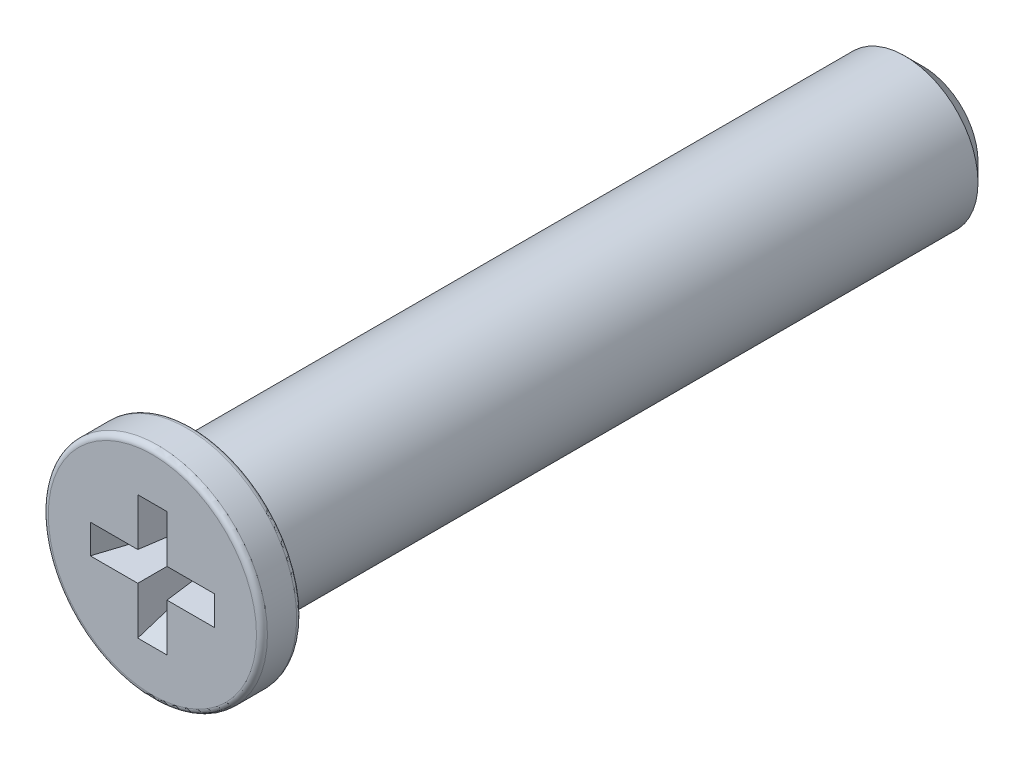
ISO-10303-21;
HEADER;
FILE_DESCRIPTION(('STEP AP214'),'2;1');
FILE_NAME('part.step','',(''),(''),'','','');
FILE_SCHEMA(('AUTOMOTIVE_DESIGN { 1 0 10303 214 1 1 1 1 }'));
ENDSEC;
DATA;
#1=APPLICATION_CONTEXT('core data for automotive mechanical design processes');
#2=APPLICATION_PROTOCOL_DEFINITION('international standard','automotive_design',2000,#1);
#3=PRODUCT_CONTEXT('',#1,'mechanical');
#4=PRODUCT('Part','Part','',(#3));
#5=PRODUCT_RELATED_PRODUCT_CATEGORY('part','',(#4));
#6=PRODUCT_DEFINITION_FORMATION('','',#4);
#7=PRODUCT_DEFINITION_CONTEXT('part definition',#1,'design');
#8=PRODUCT_DEFINITION('design','',#6,#7);
#9=PRODUCT_DEFINITION_SHAPE('','',#8);
#10=(LENGTH_UNIT() NAMED_UNIT(*) SI_UNIT(.MILLI.,.METRE.));
#11=(NAMED_UNIT(*) PLANE_ANGLE_UNIT() SI_UNIT($,.RADIAN.));
#12=(NAMED_UNIT(*) SI_UNIT($,.STERADIAN.) SOLID_ANGLE_UNIT());
#13=UNCERTAINTY_MEASURE_WITH_UNIT(LENGTH_MEASURE(1.E-05),#10,'distance_accuracy_value','');
#14=(GEOMETRIC_REPRESENTATION_CONTEXT(3) GLOBAL_UNCERTAINTY_ASSIGNED_CONTEXT((#13)) GLOBAL_UNIT_ASSIGNED_CONTEXT((#10,
#11,#12)) REPRESENTATION_CONTEXT('',''));
#15=CARTESIAN_POINT('',(0.,0.,0.));
#16=DIRECTION('',(0.,0.,1.));
#17=DIRECTION('',(1.,0.,0.));
#18=AXIS2_PLACEMENT_3D('',#15,#16,#17);
#19=CARTESIAN_POINT('',(12.1,11.25,7.5));
#20=DIRECTION('',(-0.923879532511287,0.,0.38268343236509));
#21=DIRECTION('',(0.38268343236509,0.,0.923879532511287));
#22=AXIS2_PLACEMENT_3D('',#19,#20,#21);
#23=PLANE('',#22);
#24=DIRECTION('',(0.,1.,0.));
#25=VECTOR('',#24,1.);
#26=CARTESIAN_POINT('',(11.6029437251523,11.25,6.30000000000001));
#27=LINE('',#26,#25);
#28=CARTESIAN_POINT('',(11.6029437251523,11.3660878256678,6.3));
#29=VERTEX_POINT('',#28);
#30=CARTESIAN_POINT('',(11.6029437251523,11.1339121743322,6.3));
#31=VERTEX_POINT('',#30);
#32=EDGE_CURVE('E117',#29,#31,#27,.F.);
#33=ORIENTED_EDGE('',*,*,#32,.T.);
#34=DIRECTION('',(-0.381887326256782,0.0644695530821726,-0.921957562347547));
#35=VECTOR('',#34,1.);
#36=CARTESIAN_POINT('',(12.1,11.05,7.5));
#37=LINE('',#36,#35);
#38=CARTESIAN_POINT('',(12.1,11.05,7.5));
#39=VERTEX_POINT('',#38);
#40=EDGE_CURVE('E133',#39,#31,#37,.T.);
#41=ORIENTED_EDGE('',*,*,#40,.F.);
#42=DIRECTION('',(0.,1.,0.));
#43=VECTOR('',#42,1.);
#44=CARTESIAN_POINT('',(12.1,11.25,7.5));
#45=LINE('',#44,#43);
#46=CARTESIAN_POINT('',(12.1,11.45,7.5));
#47=VERTEX_POINT('',#46);
#48=EDGE_CURVE('E122',#39,#47,#45,.T.);
#49=ORIENTED_EDGE('',*,*,#48,.T.);
#50=DIRECTION('',(0.381887326256781,0.0644695530821739,0.921957562347547));
#51=VECTOR('',#50,1.);
#52=CARTESIAN_POINT('',(11.6029437251523,11.3660878256678,6.3));
#53=LINE('',#52,#51);
#54=EDGE_CURVE('E286',#29,#47,#53,.T.);
#55=ORIENTED_EDGE('',*,*,#54,.F.);
#56=EDGE_LOOP('',(#33,#41,#49,#55));
#57=FACE_BOUND('',#56,.T.);
#58=ADVANCED_FACE('F17',(#57),#23,.T.);
#59=CARTESIAN_POINT('',(11.25,11.05,7.5));
#60=DIRECTION('',(0.,0.997564050259824,0.0697564737441253));
#61=DIRECTION('',(0.,-0.0697564737441253,0.997564050259824));
#62=AXIS2_PLACEMENT_3D('',#59,#60,#61);
#63=PLANE('',#62);
#64=DIRECTION('',(1.,0.,0.));
#65=VECTOR('',#64,1.);
#66=CARTESIAN_POINT('',(11.25,11.1339121743322,6.3));
#67=LINE('',#66,#65);
#68=CARTESIAN_POINT('',(11.3660878256678,11.1339121743322,6.3));
#69=VERTEX_POINT('',#68);
#70=EDGE_CURVE('E135',#31,#69,#67,.F.);
#71=ORIENTED_EDGE('',*,*,#70,.T.);
#72=DIRECTION('',(-0.0695873743166644,0.0695873743166544,-0.995145815783509));
#73=VECTOR('',#72,1.);
#74=CARTESIAN_POINT('',(11.45,11.05,7.5));
#75=LINE('',#74,#73);
#76=CARTESIAN_POINT('',(11.45,11.05,7.5));
#77=VERTEX_POINT('',#76);
#78=EDGE_CURVE('E139',#77,#69,#75,.T.);
#79=ORIENTED_EDGE('',*,*,#78,.F.);
#80=DIRECTION('',(1.,0.,0.));
#81=VECTOR('',#80,1.);
#82=CARTESIAN_POINT('',(11.25,11.05,7.5));
#83=LINE('',#82,#81);
#84=EDGE_CURVE('E126',#77,#39,#83,.T.);
#85=ORIENTED_EDGE('',*,*,#84,.T.);
#86=ORIENTED_EDGE('',*,*,#40,.T.);
#87=EDGE_LOOP('',(#71,#79,#85,#86));
#88=FACE_BOUND('',#87,.T.);
#89=ADVANCED_FACE('F137',(#88),#63,.T.);
#90=CARTESIAN_POINT('',(11.25,11.45,7.5));
#91=DIRECTION('',(0.,-0.997564050259824,0.0697564737441253));
#92=DIRECTION('',(0.,-0.0697564737441253,-0.997564050259824));
#93=AXIS2_PLACEMENT_3D('',#90,#91,#92);
#94=PLANE('',#93);
#95=DIRECTION('',(1.,0.,0.));
#96=VECTOR('',#95,1.);
#97=CARTESIAN_POINT('',(11.25,11.3660878256678,6.3));
#98=LINE('',#97,#96);
#99=CARTESIAN_POINT('',(11.3660878256678,11.3660878256678,6.3));
#100=VERTEX_POINT('',#99);
#101=EDGE_CURVE('E288',#100,#29,#98,.T.);
#102=ORIENTED_EDGE('',*,*,#101,.T.);
#103=ORIENTED_EDGE('',*,*,#54,.T.);
#104=DIRECTION('',(1.,0.,0.));
#105=VECTOR('',#104,1.);
#106=CARTESIAN_POINT('',(11.25,11.45,7.5));
#107=LINE('',#106,#105);
#108=CARTESIAN_POINT('',(11.45,11.45,7.5));
#109=VERTEX_POINT('',#108);
#110=EDGE_CURVE('E129',#47,#109,#107,.F.);
#111=ORIENTED_EDGE('',*,*,#110,.T.);
#112=DIRECTION('',(0.0695873743166644,0.0695873743166544,0.995145815783509));
#113=VECTOR('',#112,1.);
#114=CARTESIAN_POINT('',(11.3660878256678,11.3660878256678,6.3));
#115=LINE('',#114,#113);
#116=EDGE_CURVE('E272',#100,#109,#115,.T.);
#117=ORIENTED_EDGE('',*,*,#116,.F.);
#118=EDGE_LOOP('',(#102,#103,#111,#117));
#119=FACE_BOUND('',#118,.T.);
#120=ADVANCED_FACE('F459',(#119),#94,.T.);
#121=CARTESIAN_POINT('',(11.45,11.25,7.5));
#122=DIRECTION('',(-0.997564050259824,0.,0.0697564737441253));
#123=DIRECTION('',(0.0697564737441253,0.,0.997564050259824));
#124=AXIS2_PLACEMENT_3D('',#121,#122,#123);
#125=PLANE('',#124);
#126=DIRECTION('',(0.,1.,0.));
#127=VECTOR('',#126,1.);
#128=CARTESIAN_POINT('',(11.3660878256678,11.25,6.3));
#129=LINE('',#128,#127);
#130=CARTESIAN_POINT('',(11.3660878256678,10.8970562748477,6.3));
#131=VERTEX_POINT('',#130);
#132=EDGE_CURVE('E281',#69,#131,#129,.F.);
#133=ORIENTED_EDGE('',*,*,#132,.T.);
#134=DIRECTION('',(-0.0644695530821647,0.381887326256791,-0.921957562347544));
#135=VECTOR('',#134,1.);
#136=CARTESIAN_POINT('',(11.45,10.4,7.5));
#137=LINE('',#136,#135);
#138=CARTESIAN_POINT('',(11.45,10.4,7.5));
#139=VERTEX_POINT('',#138);
#140=EDGE_CURVE('E266',#139,#131,#137,.T.);
#141=ORIENTED_EDGE('',*,*,#140,.F.);
#142=DIRECTION('',(0.,1.,0.));
#143=VECTOR('',#142,1.);
#144=CARTESIAN_POINT('',(11.45,11.25,7.5));
#145=LINE('',#144,#143);
#146=EDGE_CURVE('E284',#139,#77,#145,.T.);
#147=ORIENTED_EDGE('',*,*,#146,.T.);
#148=ORIENTED_EDGE('',*,*,#78,.T.);
#149=EDGE_LOOP('',(#133,#141,#147,#148));
#150=FACE_BOUND('',#149,.T.);
#151=ADVANCED_FACE('F298',(#150),#125,.T.);
#152=CARTESIAN_POINT('',(11.45,11.25,7.5));
#153=DIRECTION('',(-0.997564050259824,0.,0.0697564737441253));
#154=DIRECTION('',(0.0697564737441253,0.,0.997564050259824));
#155=AXIS2_PLACEMENT_3D('',#152,#153,#154);
#156=PLANE('',#155);
#157=DIRECTION('',(0.,1.,0.));
#158=VECTOR('',#157,1.);
#159=CARTESIAN_POINT('',(11.3660878256678,11.25,6.3));
#160=LINE('',#159,#158);
#161=CARTESIAN_POINT('',(11.3660878256678,11.6029437251523,6.3));
#162=VERTEX_POINT('',#161);
#163=EDGE_CURVE('E275',#162,#100,#160,.F.);
#164=ORIENTED_EDGE('',*,*,#163,.T.);
#165=ORIENTED_EDGE('',*,*,#116,.T.);
#166=DIRECTION('',(0.,1.,0.));
#167=VECTOR('',#166,1.);
#168=CARTESIAN_POINT('',(11.45,11.25,7.5));
#169=LINE('',#168,#167);
#170=CARTESIAN_POINT('',(11.45,12.1,7.5));
#171=VERTEX_POINT('',#170);
#172=EDGE_CURVE('E278',#109,#171,#169,.T.);
#173=ORIENTED_EDGE('',*,*,#172,.T.);
#174=DIRECTION('',(0.0644695530821646,0.381887326256791,0.921957562347544));
#175=VECTOR('',#174,1.);
#176=CARTESIAN_POINT('',(11.3660878256678,11.6029437251523,6.30000000000001));
#177=LINE('',#176,#175);
#178=EDGE_CURVE('E255',#162,#171,#177,.T.);
#179=ORIENTED_EDGE('',*,*,#178,.F.);
#180=EDGE_LOOP('',(#164,#165,#173,#179));
#181=FACE_BOUND('',#180,.T.);
#182=ADVANCED_FACE('F445',(#181),#156,.T.);
#183=CARTESIAN_POINT('',(11.25,10.4,7.5));
#184=DIRECTION('',(0.,0.923879532511287,0.38268343236509));
#185=DIRECTION('',(0.,-0.38268343236509,0.923879532511287));
#186=AXIS2_PLACEMENT_3D('',#183,#184,#185);
#187=PLANE('',#186);
#188=DIRECTION('',(1.,0.,0.));
#189=VECTOR('',#188,1.);
#190=CARTESIAN_POINT('',(11.25,10.8970562748477,6.30000000000001));
#191=LINE('',#190,#189);
#192=CARTESIAN_POINT('',(11.1339121743322,10.8970562748477,6.3));
#193=VERTEX_POINT('',#192);
#194=EDGE_CURVE('E264',#131,#193,#191,.F.);
#195=ORIENTED_EDGE('',*,*,#194,.T.);
#196=DIRECTION('',(0.0644695530821727,0.38188732625678,-0.921957562347548));
#197=VECTOR('',#196,1.);
#198=CARTESIAN_POINT('',(11.05,10.4,7.5));
#199=LINE('',#198,#197);
#200=CARTESIAN_POINT('',(11.05,10.4,7.5));
#201=VERTEX_POINT('',#200);
#202=EDGE_CURVE('E249',#201,#193,#199,.T.);
#203=ORIENTED_EDGE('',*,*,#202,.F.);
#204=DIRECTION('',(1.,0.,0.));
#205=VECTOR('',#204,1.);
#206=CARTESIAN_POINT('',(11.25,10.4,7.5));
#207=LINE('',#206,#205);
#208=EDGE_CURVE('E269',#201,#139,#207,.T.);
#209=ORIENTED_EDGE('',*,*,#208,.T.);
#210=ORIENTED_EDGE('',*,*,#140,.T.);
#211=EDGE_LOOP('',(#195,#203,#209,#210));
#212=FACE_BOUND('',#211,.T.);
#213=ADVANCED_FACE('F302',(#212),#187,.T.);
#214=CARTESIAN_POINT('',(11.25,12.1,7.5));
#215=DIRECTION('',(0.,-0.923879532511287,0.38268343236509));
#216=DIRECTION('',(0.,-0.38268343236509,-0.923879532511287));
#217=AXIS2_PLACEMENT_3D('',#214,#215,#216);
#218=PLANE('',#217);
#219=DIRECTION('',(1.,0.,0.));
#220=VECTOR('',#219,1.);
#221=CARTESIAN_POINT('',(11.25,11.6029437251523,6.30000000000001));
#222=LINE('',#221,#220);
#223=CARTESIAN_POINT('',(11.1339121743322,11.6029437251523,6.3));
#224=VERTEX_POINT('',#223);
#225=EDGE_CURVE('E258',#224,#162,#222,.T.);
#226=ORIENTED_EDGE('',*,*,#225,.T.);
#227=ORIENTED_EDGE('',*,*,#178,.T.);
#228=DIRECTION('',(1.,0.,0.));
#229=VECTOR('',#228,1.);
#230=CARTESIAN_POINT('',(11.25,12.1,7.5));
#231=LINE('',#230,#229);
#232=CARTESIAN_POINT('',(11.05,12.1,7.5));
#233=VERTEX_POINT('',#232);
#234=EDGE_CURVE('E261',#171,#233,#231,.F.);
#235=ORIENTED_EDGE('',*,*,#234,.T.);
#236=DIRECTION('',(-0.0644695530821739,0.381887326256781,0.921957562347547));
#237=VECTOR('',#236,1.);
#238=CARTESIAN_POINT('',(11.1339121743322,11.6029437251523,6.3));
#239=LINE('',#238,#237);
#240=EDGE_CURVE('E241',#224,#233,#239,.T.);
#241=ORIENTED_EDGE('',*,*,#240,.F.);
#242=EDGE_LOOP('',(#226,#227,#235,#241));
#243=FACE_BOUND('',#242,.T.);
#244=ADVANCED_FACE('F431',(#243),#218,.T.);
#245=CARTESIAN_POINT('',(11.05,11.25,7.5));
#246=DIRECTION('',(0.997564050259824,0.,0.0697564737441253));
#247=DIRECTION('',(0.0697564737441253,0.,-0.997564050259824));
#248=AXIS2_PLACEMENT_3D('',#245,#246,#247);
#249=PLANE('',#248);
#250=DIRECTION('',(0.,1.,0.));
#251=VECTOR('',#250,1.);
#252=CARTESIAN_POINT('',(11.1339121743322,11.25,6.3));
#253=LINE('',#252,#251);
#254=CARTESIAN_POINT('',(11.1339121743322,11.1339121743322,6.3));
#255=VERTEX_POINT('',#254);
#256=EDGE_CURVE('E247',#193,#255,#253,.T.);
#257=ORIENTED_EDGE('',*,*,#256,.T.);
#258=DIRECTION('',(0.0695873743166544,0.0695873743166644,-0.995145815783509));
#259=VECTOR('',#258,1.);
#260=CARTESIAN_POINT('',(11.05,11.05,7.5));
#261=LINE('',#260,#259);
#262=CARTESIAN_POINT('',(11.05,11.05,7.5));
#263=VERTEX_POINT('',#262);
#264=EDGE_CURVE('E235',#263,#255,#261,.T.);
#265=ORIENTED_EDGE('',*,*,#264,.F.);
#266=DIRECTION('',(0.,1.,0.));
#267=VECTOR('',#266,1.);
#268=CARTESIAN_POINT('',(11.05,11.25,7.5));
#269=LINE('',#268,#267);
#270=EDGE_CURVE('E252',#263,#201,#269,.F.);
#271=ORIENTED_EDGE('',*,*,#270,.T.);
#272=ORIENTED_EDGE('',*,*,#202,.T.);
#273=EDGE_LOOP('',(#257,#265,#271,#272));
#274=FACE_BOUND('',#273,.T.);
#275=ADVANCED_FACE('F304',(#274),#249,.T.);
#276=CARTESIAN_POINT('',(11.05,11.25,7.5));
#277=DIRECTION('',(0.997564050259824,0.,0.0697564737441253));
#278=DIRECTION('',(0.0697564737441253,0.,-0.997564050259824));
#279=AXIS2_PLACEMENT_3D('',#276,#277,#278);
#280=PLANE('',#279);
#281=DIRECTION('',(0.,1.,0.));
#282=VECTOR('',#281,1.);
#283=CARTESIAN_POINT('',(11.1339121743322,11.25,6.3));
#284=LINE('',#283,#282);
#285=CARTESIAN_POINT('',(11.1339121743322,11.3660878256678,6.3));
#286=VERTEX_POINT('',#285);
#287=EDGE_CURVE('E230',#224,#286,#284,.F.);
#288=ORIENTED_EDGE('',*,*,#287,.F.);
#289=ORIENTED_EDGE('',*,*,#240,.T.);
#290=DIRECTION('',(0.,1.,0.));
#291=VECTOR('',#290,1.);
#292=CARTESIAN_POINT('',(11.05,11.25,7.5));
#293=LINE('',#292,#291);
#294=CARTESIAN_POINT('',(11.05,11.45,7.5));
#295=VERTEX_POINT('',#294);
#296=EDGE_CURVE('E244',#233,#295,#293,.F.);
#297=ORIENTED_EDGE('',*,*,#296,.T.);
#298=DIRECTION('',(-0.0695873743166544,0.0695873743166644,0.995145815783509));
#299=VECTOR('',#298,1.);
#300=CARTESIAN_POINT('',(11.1339121743322,11.3660878256678,6.3));
#301=LINE('',#300,#299);
#302=EDGE_CURVE('E222',#286,#295,#301,.T.);
#303=ORIENTED_EDGE('',*,*,#302,.F.);
#304=EDGE_LOOP('',(#288,#289,#297,#303));
#305=FACE_BOUND('',#304,.T.);
#306=ADVANCED_FACE('F417',(#305),#280,.T.);
#307=CARTESIAN_POINT('',(11.25,11.05,7.5));
#308=DIRECTION('',(0.,0.997564050259824,0.0697564737441253));
#309=DIRECTION('',(0.,-0.0697564737441253,0.997564050259824));
#310=AXIS2_PLACEMENT_3D('',#307,#308,#309);
#311=PLANE('',#310);
#312=DIRECTION('',(1.,0.,0.));
#313=VECTOR('',#312,1.);
#314=CARTESIAN_POINT('',(11.25,11.1339121743322,6.3));
#315=LINE('',#314,#313);
#316=CARTESIAN_POINT('',(10.8970562748477,11.1339121743322,6.3));
#317=VERTEX_POINT('',#316);
#318=EDGE_CURVE('E232',#317,#255,#315,.T.);
#319=ORIENTED_EDGE('',*,*,#318,.F.);
#320=DIRECTION('',(0.381887326256791,0.0644695530821647,-0.921957562347544));
#321=VECTOR('',#320,1.);
#322=CARTESIAN_POINT('',(10.4,11.05,7.5));
#323=LINE('',#322,#321);
#324=CARTESIAN_POINT('',(10.4,11.05,7.5));
#325=VERTEX_POINT('',#324);
#326=EDGE_CURVE('E219',#325,#317,#323,.T.);
#327=ORIENTED_EDGE('',*,*,#326,.F.);
#328=DIRECTION('',(1.,0.,0.));
#329=VECTOR('',#328,1.);
#330=CARTESIAN_POINT('',(11.25,11.05,7.5));
#331=LINE('',#330,#329);
#332=EDGE_CURVE('E238',#325,#263,#331,.T.);
#333=ORIENTED_EDGE('',*,*,#332,.T.);
#334=ORIENTED_EDGE('',*,*,#264,.T.);
#335=EDGE_LOOP('',(#319,#327,#333,#334));
#336=FACE_BOUND('',#335,.T.);
#337=ADVANCED_FACE('F307',(#336),#311,.T.);
#338=CARTESIAN_POINT('',(11.25,11.25,6.3));
#339=DIRECTION('',(0.,0.,1.));
#340=DIRECTION('',(1.,0.,0.));
#341=AXIS2_PLACEMENT_3D('',#338,#339,#340);
#342=PLANE('',#341);
#343=ORIENTED_EDGE('',*,*,#225,.F.);
#344=ORIENTED_EDGE('',*,*,#287,.T.);
#345=DIRECTION('',(1.,0.,0.));
#346=VECTOR('',#345,1.);
#347=CARTESIAN_POINT('',(11.25,11.3660878256678,6.3));
#348=LINE('',#347,#346);
#349=CARTESIAN_POINT('',(10.8970562748477,11.3660878256678,6.3));
#350=VERTEX_POINT('',#349);
#351=EDGE_CURVE('E225',#350,#286,#348,.T.);
#352=ORIENTED_EDGE('',*,*,#351,.F.);
#353=DIRECTION('',(0.,1.,0.));
#354=VECTOR('',#353,1.);
#355=CARTESIAN_POINT('',(10.8970562748477,11.25,6.30000000000001));
#356=LINE('',#355,#354);
#357=EDGE_CURVE('E216',#317,#350,#356,.T.);
#358=ORIENTED_EDGE('',*,*,#357,.F.);
#359=ORIENTED_EDGE('',*,*,#318,.T.);
#360=ORIENTED_EDGE('',*,*,#256,.F.);
#361=ORIENTED_EDGE('',*,*,#194,.F.);
#362=ORIENTED_EDGE('',*,*,#132,.F.);
#363=ORIENTED_EDGE('',*,*,#70,.F.);
#364=ORIENTED_EDGE('',*,*,#32,.F.);
#365=ORIENTED_EDGE('',*,*,#101,.F.);
#366=ORIENTED_EDGE('',*,*,#163,.F.);
#367=EDGE_LOOP('',(#343,#344,#352,#358,#359,#360,#361,#362,#363,#364,#365,#366));
#368=FACE_BOUND('',#367,.T.);
#369=ADVANCED_FACE('F294',(#368),#342,.T.);
#370=CARTESIAN_POINT('',(11.25,11.45,7.5));
#371=DIRECTION('',(0.,-0.997564050259824,0.0697564737441253));
#372=DIRECTION('',(0.,-0.0697564737441253,-0.997564050259824));
#373=AXIS2_PLACEMENT_3D('',#370,#371,#372);
#374=PLANE('',#373);
#375=ORIENTED_EDGE('',*,*,#351,.T.);
#376=ORIENTED_EDGE('',*,*,#302,.T.);
#377=DIRECTION('',(1.,0.,0.));
#378=VECTOR('',#377,1.);
#379=CARTESIAN_POINT('',(11.25,11.45,7.5));
#380=LINE('',#379,#378);
#381=CARTESIAN_POINT('',(10.4,11.45,7.5));
#382=VERTEX_POINT('',#381);
#383=EDGE_CURVE('E228',#295,#382,#380,.F.);
#384=ORIENTED_EDGE('',*,*,#383,.T.);
#385=DIRECTION('',(-0.381887326256791,0.0644695530821647,0.921957562347544));
#386=VECTOR('',#385,1.);
#387=CARTESIAN_POINT('',(10.8970562748477,11.3660878256678,6.30000000000001));
#388=LINE('',#387,#386);
#389=EDGE_CURVE('E207',#350,#382,#388,.T.);
#390=ORIENTED_EDGE('',*,*,#389,.F.);
#391=EDGE_LOOP('',(#375,#376,#384,#390));
#392=FACE_BOUND('',#391,.T.);
#393=ADVANCED_FACE('F336',(#392),#374,.T.);
#394=CARTESIAN_POINT('',(10.4,11.25,7.5));
#395=DIRECTION('',(0.923879532511287,0.,0.38268343236509));
#396=DIRECTION('',(0.38268343236509,0.,-0.923879532511287));
#397=AXIS2_PLACEMENT_3D('',#394,#395,#396);
#398=PLANE('',#397);
#399=ORIENTED_EDGE('',*,*,#357,.T.);
#400=ORIENTED_EDGE('',*,*,#389,.T.);
#401=DIRECTION('',(0.,1.,0.));
#402=VECTOR('',#401,1.);
#403=CARTESIAN_POINT('',(10.4,11.25,7.5));
#404=LINE('',#403,#402);
#405=EDGE_CURVE('E215',#382,#325,#404,.F.);
#406=ORIENTED_EDGE('',*,*,#405,.T.);
#407=ORIENTED_EDGE('',*,*,#326,.T.);
#408=EDGE_LOOP('',(#399,#400,#406,#407));
#409=FACE_BOUND('',#408,.T.);
#410=ADVANCED_FACE('F331',(#409),#398,.T.);
#411=CARTESIAN_POINT('',(11.25,11.25,7.5));
#412=DIRECTION('',(0.,0.,-1.));
#413=DIRECTION('',(-1.,0.,0.));
#414=AXIS2_PLACEMENT_3D('',#411,#412,#413);
#415=PLANE('',#414);
#416=ORIENTED_EDGE('',*,*,#383,.F.);
#417=ORIENTED_EDGE('',*,*,#296,.F.);
#418=ORIENTED_EDGE('',*,*,#234,.F.);
#419=ORIENTED_EDGE('',*,*,#172,.F.);
#420=ORIENTED_EDGE('',*,*,#110,.F.);
#421=ORIENTED_EDGE('',*,*,#48,.F.);
#422=ORIENTED_EDGE('',*,*,#84,.F.);
#423=ORIENTED_EDGE('',*,*,#146,.F.);
#424=ORIENTED_EDGE('',*,*,#208,.F.);
#425=ORIENTED_EDGE('',*,*,#270,.F.);
#426=ORIENTED_EDGE('',*,*,#332,.F.);
#427=ORIENTED_EDGE('',*,*,#405,.F.);
#428=EDGE_LOOP('',(#416,#417,#418,#419,#420,#421,#422,#423,#424,#425,#426,#427));
#429=FACE_BOUND('',#428,.T.);
#430=CARTESIAN_POINT('',(11.25,11.25,7.5));
#431=DIRECTION('',(0.,0.,-1.));
#432=DIRECTION('',(-1.,0.,0.));
#433=AXIS2_PLACEMENT_3D('',#430,#431,#432);
#434=CIRCLE('',#433,1.425);
#435=CARTESIAN_POINT('',(9.825,11.25,7.5));
#436=VERTEX_POINT('',#435);
#437=CARTESIAN_POINT('',(12.675,11.25,7.5));
#438=VERTEX_POINT('',#437);
#439=EDGE_CURVE('E311',#436,#438,#434,.T.);
#440=ORIENTED_EDGE('',*,*,#439,.F.);
#441=CARTESIAN_POINT('',(11.25,11.25,7.5));
#442=DIRECTION('',(0.,0.,-1.));
#443=DIRECTION('',(1.,0.,0.));
#444=AXIS2_PLACEMENT_3D('',#441,#442,#443);
#445=CIRCLE('',#444,1.425);
#446=EDGE_CURVE('E187',#438,#436,#445,.T.);
#447=ORIENTED_EDGE('',*,*,#446,.F.);
#448=EDGE_LOOP('',(#440,#447));
#449=FACE_BOUND('',#448,.T.);
#450=ADVANCED_FACE('F123',(#429,#449),#415,.F.);
#451=CARTESIAN_POINT('',(11.25,11.25,7.425));
#452=DIRECTION('',(0.,0.,-1.));
#453=DIRECTION('',(-1.,0.,0.));
#454=AXIS2_PLACEMENT_3D('',#451,#452,#453);
#455=TOROIDAL_SURFACE('',#454,1.425,0.075);
#456=CARTESIAN_POINT('',(11.25,11.25,7.425));
#457=DIRECTION('',(0.,0.,1.));
#458=DIRECTION('',(1.,0.,0.));
#459=AXIS2_PLACEMENT_3D('',#456,#457,#458);
#460=CIRCLE('',#459,1.5);
#461=CARTESIAN_POINT('',(12.75,11.25,7.425));
#462=VERTEX_POINT('',#461);
#463=EDGE_CURVE('E184',#462,#462,#460,.F.);
#464=ORIENTED_EDGE('',*,*,#463,.F.);
#465=EDGE_LOOP('',(#464));
#466=FACE_BOUND('',#465,.T.);
#467=ORIENTED_EDGE('',*,*,#446,.T.);
#468=ORIENTED_EDGE('',*,*,#439,.T.);
#469=EDGE_LOOP('',(#467,#468));
#470=FACE_BOUND('',#469,.T.);
#471=ADVANCED_FACE('F191',(#466,#470),#455,.T.);
#472=CARTESIAN_POINT('',(11.25,11.25,6.95));
#473=DIRECTION('',(0.,0.,1.));
#474=DIRECTION('',(1.,0.,0.));
#475=AXIS2_PLACEMENT_3D('',#472,#473,#474);
#476=CYLINDRICAL_SURFACE('',#475,1.5);
#477=ORIENTED_EDGE('',*,*,#463,.T.);
#478=EDGE_LOOP('',(#477));
#479=FACE_BOUND('',#478,.T.);
#480=CARTESIAN_POINT('',(11.25,11.25,7.025));
#481=DIRECTION('',(0.,0.,-1.));
#482=DIRECTION('',(-1.,0.,0.));
#483=AXIS2_PLACEMENT_3D('',#480,#481,#482);
#484=CIRCLE('',#483,1.5);
#485=CARTESIAN_POINT('',(9.75,11.25,7.025));
#486=VERTEX_POINT('',#485);
#487=EDGE_CURVE('E149',#486,#486,#484,.T.);
#488=ORIENTED_EDGE('',*,*,#487,.F.);
#489=EDGE_LOOP('',(#488));
#490=FACE_BOUND('',#489,.T.);
#491=ADVANCED_FACE('F195',(#479,#490),#476,.T.);
#492=CARTESIAN_POINT('',(11.25,11.25,-3.05));
#493=DIRECTION('',(0.,0.,-1.));
#494=DIRECTION('',(-1.,0.,0.));
#495=AXIS2_PLACEMENT_3D('',#492,#493,#494);
#496=PLANE('',#495);
#497=CARTESIAN_POINT('',(11.25,11.25,-3.04999999997335));
#498=DIRECTION('',(0.,0.,1.));
#499=DIRECTION('',(1.,0.,0.));
#500=AXIS2_PLACEMENT_3D('',#497,#498,#499);
#501=CIRCLE('',#500,0.750000000000455);
#502=CARTESIAN_POINT('',(12.0000000000005,11.25,-3.04999999997335));
#503=VERTEX_POINT('',#502);
#504=EDGE_CURVE('E145',#503,#503,#501,.T.);
#505=ORIENTED_EDGE('',*,*,#504,.F.);
#506=EDGE_LOOP('',(#505));
#507=FACE_BOUND('',#506,.T.);
#508=ADVANCED_FACE('F166',(#507),#496,.T.);
#509=CARTESIAN_POINT('',(11.25,11.25,7.025));
#510=DIRECTION('',(0.,0.,-1.));
#511=DIRECTION('',(-1.,0.,0.));
#512=AXIS2_PLACEMENT_3D('',#509,#510,#511);
#513=TOROIDAL_SURFACE('',#512,1.425,0.075);
#514=CARTESIAN_POINT('',(11.25,11.25,6.95));
#515=DIRECTION('',(0.,0.,1.));
#516=DIRECTION('',(1.,0.,0.));
#517=AXIS2_PLACEMENT_3D('',#514,#515,#516);
#518=CIRCLE('',#517,1.425);
#519=CARTESIAN_POINT('',(9.825,11.25,6.95));
#520=VERTEX_POINT('',#519);
#521=CARTESIAN_POINT('',(12.675,11.25,6.95));
#522=VERTEX_POINT('',#521);
#523=EDGE_CURVE('E148',#520,#522,#518,.F.);
#524=ORIENTED_EDGE('',*,*,#523,.F.);
#525=CARTESIAN_POINT('',(11.25,11.25,6.95));
#526=DIRECTION('',(0.,0.,1.));
#527=DIRECTION('',(-1.,0.,0.));
#528=AXIS2_PLACEMENT_3D('',#525,#526,#527);
#529=CIRCLE('',#528,1.425);
#530=EDGE_CURVE('E36',#522,#520,#529,.F.);
#531=ORIENTED_EDGE('',*,*,#530,.F.);
#532=EDGE_LOOP('',(#524,#531));
#533=FACE_BOUND('',#532,.T.);
#534=ORIENTED_EDGE('',*,*,#487,.T.);
#535=EDGE_LOOP('',(#534));
#536=FACE_BOUND('',#535,.T.);
#537=ADVANCED_FACE('F154',(#533,#536),#513,.T.);
#538=CARTESIAN_POINT('',(11.25,11.25,-2.79999999980873));
#539=DIRECTION('',(0.,0.,1.));
#540=DIRECTION('',(1.,0.,0.));
#541=AXIS2_PLACEMENT_3D('',#538,#539,#540);
#542=CONICAL_SURFACE('',#541,0.999999999710326,0.785398162487954);
#543=ORIENTED_EDGE('',*,*,#504,.T.);
#544=EDGE_LOOP('',(#543));
#545=FACE_BOUND('',#544,.T.);
#546=CARTESIAN_POINT('',(11.25,11.25,-2.8));
#547=DIRECTION('',(0.,0.,1.));
#548=DIRECTION('',(1.,0.,0.));
#549=AXIS2_PLACEMENT_3D('',#546,#547,#548);
#550=CIRCLE('',#549,1.);
#551=CARTESIAN_POINT('',(12.25,11.25,-2.8));
#552=VERTEX_POINT('',#551);
#553=EDGE_CURVE('E28',#552,#552,#550,.T.);
#554=ORIENTED_EDGE('',*,*,#553,.F.);
#555=EDGE_LOOP('',(#554));
#556=FACE_BOUND('',#555,.T.);
#557=ADVANCED_FACE('F165',(#545,#556),#542,.T.);
#558=CARTESIAN_POINT('',(11.25,11.25,6.95));
#559=DIRECTION('',(0.,0.,-1.));
#560=DIRECTION('',(-1.,0.,0.));
#561=AXIS2_PLACEMENT_3D('',#558,#559,#560);
#562=PLANE('',#561);
#563=CARTESIAN_POINT('',(11.25,11.25,6.95));
#564=DIRECTION('',(0.,0.,1.));
#565=DIRECTION('',(1.,0.,0.));
#566=AXIS2_PLACEMENT_3D('',#563,#564,#565);
#567=CIRCLE('',#566,1.);
#568=CARTESIAN_POINT('',(12.25,11.25,6.95));
#569=VERTEX_POINT('',#568);
#570=EDGE_CURVE('E11',#569,#569,#567,.F.);
#571=ORIENTED_EDGE('',*,*,#570,.F.);
#572=EDGE_LOOP('',(#571));
#573=FACE_BOUND('',#572,.T.);
#574=ORIENTED_EDGE('',*,*,#523,.T.);
#575=ORIENTED_EDGE('',*,*,#530,.T.);
#576=EDGE_LOOP('',(#574,#575));
#577=FACE_BOUND('',#576,.T.);
#578=ADVANCED_FACE('F339',(#573,#577),#562,.T.);
#579=CARTESIAN_POINT('',(11.25,11.25,-3.05));
#580=DIRECTION('',(0.,0.,1.));
#581=DIRECTION('',(1.,0.,0.));
#582=AXIS2_PLACEMENT_3D('',#579,#580,#581);
#583=CYLINDRICAL_SURFACE('',#582,1.);
#584=ORIENTED_EDGE('',*,*,#553,.T.);
#585=EDGE_LOOP('',(#584));
#586=FACE_BOUND('',#585,.T.);
#587=ORIENTED_EDGE('',*,*,#570,.T.);
#588=EDGE_LOOP('',(#587));
#589=FACE_BOUND('',#588,.T.);
#590=ADVANCED_FACE('F337',(#586,#589),#583,.T.);
#591=CLOSED_SHELL('',(#58,#89,#120,#151,#182,#213,#244,#275,#306,#337,#369,#393,#410,#450,#471,
#491,#508,#537,#557,#578,#590));
#592=MANIFOLD_SOLID_BREP('B1',#591);
#593=ADVANCED_BREP_SHAPE_REPRESENTATION('',(#18,#592),#14);
#594=SHAPE_DEFINITION_REPRESENTATION(#9,#593);
ENDSEC;
END-ISO-10303-21;
